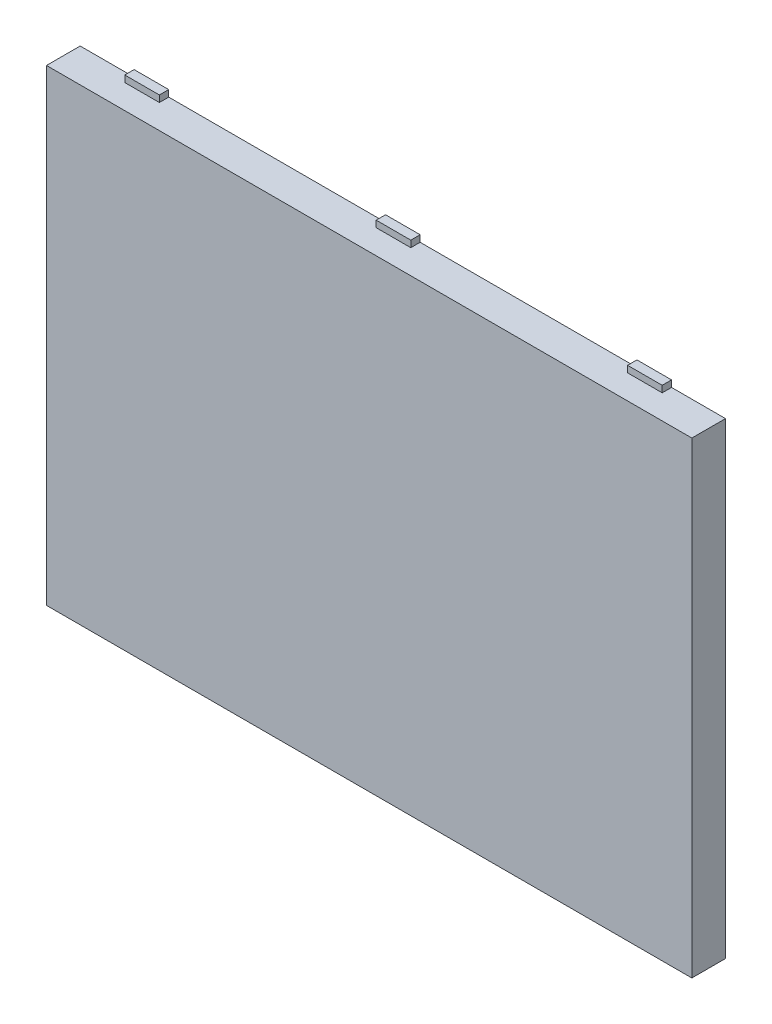
ISO-10303-21;
HEADER;
FILE_DESCRIPTION(('STEP AP214'),'2;1');
FILE_NAME('part.step','',(''),(''),'','','');
FILE_SCHEMA(('AUTOMOTIVE_DESIGN { 1 0 10303 214 1 1 1 1 }'));
ENDSEC;
DATA;
#1=APPLICATION_CONTEXT('core data for automotive mechanical design processes');
#2=APPLICATION_PROTOCOL_DEFINITION('international standard','automotive_design',2000,#1);
#3=PRODUCT_CONTEXT('',#1,'mechanical');
#4=PRODUCT('Part','Part','',(#3));
#5=PRODUCT_RELATED_PRODUCT_CATEGORY('part','',(#4));
#6=PRODUCT_DEFINITION_FORMATION('','',#4);
#7=PRODUCT_DEFINITION_CONTEXT('part definition',#1,'design');
#8=PRODUCT_DEFINITION('design','',#6,#7);
#9=PRODUCT_DEFINITION_SHAPE('','',#8);
#10=(LENGTH_UNIT() NAMED_UNIT(*) SI_UNIT(.MILLI.,.METRE.));
#11=(NAMED_UNIT(*) PLANE_ANGLE_UNIT() SI_UNIT($,.RADIAN.));
#12=(NAMED_UNIT(*) SI_UNIT($,.STERADIAN.) SOLID_ANGLE_UNIT());
#13=UNCERTAINTY_MEASURE_WITH_UNIT(LENGTH_MEASURE(1.E-05),#10,'distance_accuracy_value','');
#14=(GEOMETRIC_REPRESENTATION_CONTEXT(3) GLOBAL_UNCERTAINTY_ASSIGNED_CONTEXT((#13)) GLOBAL_UNIT_ASSIGNED_CONTEXT((#10,
#11,#12)) REPRESENTATION_CONTEXT('',''));
#15=CARTESIAN_POINT('',(0.,0.,0.));
#16=DIRECTION('',(0.,0.,1.));
#17=DIRECTION('',(1.,0.,0.));
#18=AXIS2_PLACEMENT_3D('',#15,#16,#17);
#19=CARTESIAN_POINT('',(0.,0.,3.6));
#20=DIRECTION('',(0.,0.,1.));
#21=DIRECTION('',(1.,0.,0.));
#22=AXIS2_PLACEMENT_3D('',#19,#20,#21);
#23=PLANE('',#22);
#24=DIRECTION('',(-1.,0.,0.));
#25=VECTOR('',#24,1.);
#26=CARTESIAN_POINT('',(73.977502485758,-2.387499067475,3.6));
#27=LINE('',#26,#25);
#28=CARTESIAN_POINT('',(73.977502485758,-2.387499067475,3.6));
#29=VERTEX_POINT('',#28);
#30=CARTESIAN_POINT('',(4.977502485758,-2.387499067475,3.6));
#31=VERTEX_POINT('',#30);
#32=EDGE_CURVE('E430',#29,#31,#27,.T.);
#33=ORIENTED_EDGE('',*,*,#32,.T.);
#34=DIRECTION('',(0.,-1.,0.));
#35=VECTOR('',#34,1.);
#36=CARTESIAN_POINT('',(4.977502485758,-2.387499067475,3.6));
#37=LINE('',#36,#35);
#38=CARTESIAN_POINT('',(4.977502485758,-52.38749906747,3.6));
#39=VERTEX_POINT('',#38);
#40=EDGE_CURVE('E10',#31,#39,#37,.T.);
#41=ORIENTED_EDGE('',*,*,#40,.T.);
#42=DIRECTION('',(1.,0.,0.));
#43=VECTOR('',#42,1.);
#44=CARTESIAN_POINT('',(4.977502485758,-52.38749906747,3.6));
#45=LINE('',#44,#43);
#46=CARTESIAN_POINT('',(73.977502485758,-52.38749906747,3.6));
#47=VERTEX_POINT('',#46);
#48=EDGE_CURVE('E273',#39,#47,#45,.T.);
#49=ORIENTED_EDGE('',*,*,#48,.T.);
#50=DIRECTION('',(0.,1.,0.));
#51=VECTOR('',#50,1.);
#52=CARTESIAN_POINT('',(73.977502485758,-52.38749906747,3.6));
#53=LINE('',#52,#51);
#54=EDGE_CURVE('E25',#47,#29,#53,.T.);
#55=ORIENTED_EDGE('',*,*,#54,.T.);
#56=EDGE_LOOP('',(#33,#41,#49,#55));
#57=FACE_BOUND('',#56,.T.);
#58=ADVANCED_FACE('F16',(#57),#23,.T.);
#59=CARTESIAN_POINT('',(64.509220466931,-1.687499067475,1.));
#60=DIRECTION('',(0.,1.,0.));
#61=DIRECTION('',(1.,0.,0.));
#62=AXIS2_PLACEMENT_3D('',#59,#60,#61);
#63=PLANE('',#62);
#64=DIRECTION('',(1.,0.,0.));
#65=VECTOR('',#64,1.);
#66=CARTESIAN_POINT('',(64.509220466931,-1.687499067475,1.));
#67=LINE('',#66,#65);
#68=CARTESIAN_POINT('',(64.509220466931,-1.687499067475,1.));
#69=VERTEX_POINT('',#68);
#70=CARTESIAN_POINT('',(68.209220466931,-1.687499067475,1.));
#71=VERTEX_POINT('',#70);
#72=EDGE_CURVE('E449',#69,#71,#67,.T.);
#73=ORIENTED_EDGE('',*,*,#72,.T.);
#74=DIRECTION('',(0.,0.,-1.));
#75=VECTOR('',#74,1.);
#76=CARTESIAN_POINT('',(68.209220466931,-1.687499067475,1.));
#77=LINE('',#76,#75);
#78=CARTESIAN_POINT('',(68.209220466931,-1.687499067475,0.));
#79=VERTEX_POINT('',#78);
#80=EDGE_CURVE('E378',#71,#79,#77,.T.);
#81=ORIENTED_EDGE('',*,*,#80,.T.);
#82=DIRECTION('',(1.,0.,0.));
#83=VECTOR('',#82,1.);
#84=CARTESIAN_POINT('',(64.509220466931,-1.687499067475,0.));
#85=LINE('',#84,#83);
#86=CARTESIAN_POINT('',(64.509220466931,-1.687499067475,0.));
#87=VERTEX_POINT('',#86);
#88=EDGE_CURVE('E448',#87,#79,#85,.T.);
#89=ORIENTED_EDGE('',*,*,#88,.F.);
#90=DIRECTION('',(0.,0.,-1.));
#91=VECTOR('',#90,1.);
#92=CARTESIAN_POINT('',(64.509220466931,-1.687499067475,1.));
#93=LINE('',#92,#91);
#94=EDGE_CURVE('E374',#69,#87,#93,.T.);
#95=ORIENTED_EDGE('',*,*,#94,.F.);
#96=EDGE_LOOP('',(#73,#81,#89,#95));
#97=FACE_BOUND('',#96,.T.);
#98=ADVANCED_FACE('F637',(#97),#63,.T.);
#99=CARTESIAN_POINT('',(37.627502485758,-1.687499067475,1.));
#100=DIRECTION('',(0.,1.,0.));
#101=DIRECTION('',(1.,0.,0.));
#102=AXIS2_PLACEMENT_3D('',#99,#100,#101);
#103=PLANE('',#102);
#104=DIRECTION('',(1.,0.,0.));
#105=VECTOR('',#104,1.);
#106=CARTESIAN_POINT('',(37.627502485758,-1.687499067475,1.));
#107=LINE('',#106,#105);
#108=CARTESIAN_POINT('',(37.627502485758,-1.687499067475,1.));
#109=VERTEX_POINT('',#108);
#110=CARTESIAN_POINT('',(41.327502485758,-1.687499067475,1.));
#111=VERTEX_POINT('',#110);
#112=EDGE_CURVE('E338',#109,#111,#107,.T.);
#113=ORIENTED_EDGE('',*,*,#112,.T.);
#114=DIRECTION('',(0.,0.,-1.));
#115=VECTOR('',#114,1.);
#116=CARTESIAN_POINT('',(41.327502485758,-1.687499067475,1.));
#117=LINE('',#116,#115);
#118=CARTESIAN_POINT('',(41.327502485758,-1.687499067475,0.));
#119=VERTEX_POINT('',#118);
#120=EDGE_CURVE('E388',#111,#119,#117,.T.);
#121=ORIENTED_EDGE('',*,*,#120,.T.);
#122=DIRECTION('',(1.,0.,0.));
#123=VECTOR('',#122,1.);
#124=CARTESIAN_POINT('',(37.627502485758,-1.687499067475,0.));
#125=LINE('',#124,#123);
#126=CARTESIAN_POINT('',(37.627502485758,-1.687499067475,0.));
#127=VERTEX_POINT('',#126);
#128=EDGE_CURVE('E421',#127,#119,#125,.T.);
#129=ORIENTED_EDGE('',*,*,#128,.F.);
#130=DIRECTION('',(0.,0.,-1.));
#131=VECTOR('',#130,1.);
#132=CARTESIAN_POINT('',(37.627502485758,-1.687499067475,1.));
#133=LINE('',#132,#131);
#134=EDGE_CURVE('E384',#109,#127,#133,.T.);
#135=ORIENTED_EDGE('',*,*,#134,.F.);
#136=EDGE_LOOP('',(#113,#121,#129,#135));
#137=FACE_BOUND('',#136,.T.);
#138=ADVANCED_FACE('F18',(#137),#103,.T.);
#139=CARTESIAN_POINT('',(10.745784504586,-1.687499067475,1.));
#140=DIRECTION('',(0.,1.,0.));
#141=DIRECTION('',(1.,0.,0.));
#142=AXIS2_PLACEMENT_3D('',#139,#140,#141);
#143=PLANE('',#142);
#144=DIRECTION('',(1.,0.,0.));
#145=VECTOR('',#144,1.);
#146=CARTESIAN_POINT('',(10.745784504586,-1.687499067475,1.));
#147=LINE('',#146,#145);
#148=CARTESIAN_POINT('',(10.745784504586,-1.687499067475,1.));
#149=VERTEX_POINT('',#148);
#150=CARTESIAN_POINT('',(14.445784504586,-1.687499067475,1.));
#151=VERTEX_POINT('',#150);
#152=EDGE_CURVE('E535',#149,#151,#147,.T.);
#153=ORIENTED_EDGE('',*,*,#152,.T.);
#154=DIRECTION('',(0.,0.,-1.));
#155=VECTOR('',#154,1.);
#156=CARTESIAN_POINT('',(14.445784504586,-1.687499067475,1.));
#157=LINE('',#156,#155);
#158=CARTESIAN_POINT('',(14.445784504586,-1.687499067475,0.));
#159=VERTEX_POINT('',#158);
#160=EDGE_CURVE('E547',#151,#159,#157,.T.);
#161=ORIENTED_EDGE('',*,*,#160,.T.);
#162=DIRECTION('',(1.,0.,0.));
#163=VECTOR('',#162,1.);
#164=CARTESIAN_POINT('',(10.745784504586,-1.687499067475,0.));
#165=LINE('',#164,#163);
#166=CARTESIAN_POINT('',(10.745784504586,-1.687499067475,0.));
#167=VERTEX_POINT('',#166);
#168=EDGE_CURVE('E401',#167,#159,#165,.T.);
#169=ORIENTED_EDGE('',*,*,#168,.F.);
#170=DIRECTION('',(0.,0.,-1.));
#171=VECTOR('',#170,1.);
#172=CARTESIAN_POINT('',(10.745784504586,-1.687499067475,1.));
#173=LINE('',#172,#171);
#174=EDGE_CURVE('E550',#149,#167,#173,.T.);
#175=ORIENTED_EDGE('',*,*,#174,.F.);
#176=EDGE_LOOP('',(#153,#161,#169,#175));
#177=FACE_BOUND('',#176,.T.);
#178=ADVANCED_FACE('F706',(#177),#143,.T.);
#179=CARTESIAN_POINT('',(4.977502485758,-2.387499067475,0.));
#180=DIRECTION('',(-1.,0.,0.));
#181=DIRECTION('',(0.,0.,1.));
#182=AXIS2_PLACEMENT_3D('',#179,#180,#181);
#183=PLANE('',#182);
#184=DIRECTION('',(0.,-1.,0.));
#185=VECTOR('',#184,1.);
#186=CARTESIAN_POINT('',(4.977502485758,-2.387499067475,0.));
#187=LINE('',#186,#185);
#188=CARTESIAN_POINT('',(4.977502485758,-2.387499067475,0.));
#189=VERTEX_POINT('',#188);
#190=CARTESIAN_POINT('',(4.977502485758,-52.38749906747,0.));
#191=VERTEX_POINT('',#190);
#192=EDGE_CURVE('E359',#189,#191,#187,.T.);
#193=ORIENTED_EDGE('',*,*,#192,.T.);
#194=DIRECTION('',(0.,0.,1.));
#195=VECTOR('',#194,1.);
#196=CARTESIAN_POINT('',(4.977502485758,-52.38749906747,0.));
#197=LINE('',#196,#195);
#198=EDGE_CURVE('E303',#191,#39,#197,.T.);
#199=ORIENTED_EDGE('',*,*,#198,.T.);
#200=ORIENTED_EDGE('',*,*,#40,.F.);
#201=DIRECTION('',(0.,0.,1.));
#202=VECTOR('',#201,1.);
#203=CARTESIAN_POINT('',(4.977502485758,-2.387499067475,0.));
#204=LINE('',#203,#202);
#205=EDGE_CURVE('E323',#189,#31,#204,.T.);
#206=ORIENTED_EDGE('',*,*,#205,.F.);
#207=EDGE_LOOP('',(#193,#199,#200,#206));
#208=FACE_BOUND('',#207,.T.);
#209=ADVANCED_FACE('F582',(#208),#183,.T.);
#210=CARTESIAN_POINT('',(14.445784504586,-53.08749906747,1.));
#211=DIRECTION('',(0.,-1.,0.));
#212=DIRECTION('',(0.,0.,-1.));
#213=AXIS2_PLACEMENT_3D('',#210,#211,#212);
#214=PLANE('',#213);
#215=DIRECTION('',(-1.,0.,0.));
#216=VECTOR('',#215,1.);
#217=CARTESIAN_POINT('',(14.445784504586,-53.08749906747,1.));
#218=LINE('',#217,#216);
#219=CARTESIAN_POINT('',(14.445784504586,-53.08749906747,1.));
#220=VERTEX_POINT('',#219);
#221=CARTESIAN_POINT('',(10.745784504586,-53.08749906747,1.));
#222=VERTEX_POINT('',#221);
#223=EDGE_CURVE('E509',#220,#222,#218,.T.);
#224=ORIENTED_EDGE('',*,*,#223,.T.);
#225=DIRECTION('',(0.,0.,-1.));
#226=VECTOR('',#225,1.);
#227=CARTESIAN_POINT('',(10.745784504586,-53.08749906747,1.));
#228=LINE('',#227,#226);
#229=CARTESIAN_POINT('',(10.745784504586,-53.08749906747,0.));
#230=VERTEX_POINT('',#229);
#231=EDGE_CURVE('E523',#222,#230,#228,.T.);
#232=ORIENTED_EDGE('',*,*,#231,.T.);
#233=DIRECTION('',(-1.,0.,0.));
#234=VECTOR('',#233,1.);
#235=CARTESIAN_POINT('',(14.445784504586,-53.08749906747,0.));
#236=LINE('',#235,#234);
#237=CARTESIAN_POINT('',(14.445784504586,-53.08749906747,0.));
#238=VERTEX_POINT('',#237);
#239=EDGE_CURVE('E379',#238,#230,#236,.T.);
#240=ORIENTED_EDGE('',*,*,#239,.F.);
#241=DIRECTION('',(0.,0.,-1.));
#242=VECTOR('',#241,1.);
#243=CARTESIAN_POINT('',(14.445784504586,-53.08749906747,1.));
#244=LINE('',#243,#242);
#245=EDGE_CURVE('E526',#220,#238,#244,.T.);
#246=ORIENTED_EDGE('',*,*,#245,.F.);
#247=EDGE_LOOP('',(#224,#232,#240,#246));
#248=FACE_BOUND('',#247,.T.);
#249=ADVANCED_FACE('F633',(#248),#214,.T.);
#250=CARTESIAN_POINT('',(41.327502485758,-53.08749906747,1.));
#251=DIRECTION('',(0.,-1.,0.));
#252=DIRECTION('',(0.,0.,-1.));
#253=AXIS2_PLACEMENT_3D('',#250,#251,#252);
#254=PLANE('',#253);
#255=DIRECTION('',(-1.,0.,0.));
#256=VECTOR('',#255,1.);
#257=CARTESIAN_POINT('',(41.327502485758,-53.08749906747,1.));
#258=LINE('',#257,#256);
#259=CARTESIAN_POINT('',(41.327502485758,-53.08749906747,1.));
#260=VERTEX_POINT('',#259);
#261=CARTESIAN_POINT('',(37.627502485758,-53.08749906747,1.));
#262=VERTEX_POINT('',#261);
#263=EDGE_CURVE('E363',#260,#262,#258,.T.);
#264=ORIENTED_EDGE('',*,*,#263,.T.);
#265=DIRECTION('',(0.,0.,-1.));
#266=VECTOR('',#265,1.);
#267=CARTESIAN_POINT('',(37.627502485758,-53.08749906747,1.));
#268=LINE('',#267,#266);
#269=CARTESIAN_POINT('',(37.627502485758,-53.08749906747,0.));
#270=VERTEX_POINT('',#269);
#271=EDGE_CURVE('E47',#262,#270,#268,.T.);
#272=ORIENTED_EDGE('',*,*,#271,.T.);
#273=DIRECTION('',(-1.,0.,0.));
#274=VECTOR('',#273,1.);
#275=CARTESIAN_POINT('',(41.327502485758,-53.08749906747,0.));
#276=LINE('',#275,#274);
#277=CARTESIAN_POINT('',(41.327502485758,-53.08749906747,0.));
#278=VERTEX_POINT('',#277);
#279=EDGE_CURVE('E353',#278,#270,#276,.T.);
#280=ORIENTED_EDGE('',*,*,#279,.F.);
#281=DIRECTION('',(0.,0.,-1.));
#282=VECTOR('',#281,1.);
#283=CARTESIAN_POINT('',(41.327502485758,-53.08749906747,1.));
#284=LINE('',#283,#282);
#285=EDGE_CURVE('E37',#260,#278,#284,.T.);
#286=ORIENTED_EDGE('',*,*,#285,.F.);
#287=EDGE_LOOP('',(#264,#272,#280,#286));
#288=FACE_BOUND('',#287,.T.);
#289=ADVANCED_FACE('F625',(#288),#254,.T.);
#290=CARTESIAN_POINT('',(68.209220466931,-53.08749906747,1.));
#291=DIRECTION('',(0.,-1.,0.));
#292=DIRECTION('',(0.,0.,-1.));
#293=AXIS2_PLACEMENT_3D('',#290,#291,#292);
#294=PLANE('',#293);
#295=DIRECTION('',(-1.,0.,0.));
#296=VECTOR('',#295,1.);
#297=CARTESIAN_POINT('',(68.209220466931,-53.08749906747,1.));
#298=LINE('',#297,#296);
#299=CARTESIAN_POINT('',(68.209220466931,-53.08749906747,1.));
#300=VERTEX_POINT('',#299);
#301=CARTESIAN_POINT('',(64.509220466931,-53.08749906747,1.));
#302=VERTEX_POINT('',#301);
#303=EDGE_CURVE('E486',#300,#302,#298,.T.);
#304=ORIENTED_EDGE('',*,*,#303,.T.);
#305=DIRECTION('',(0.,0.,-1.));
#306=VECTOR('',#305,1.);
#307=CARTESIAN_POINT('',(64.509220466931,-53.08749906747,1.));
#308=LINE('',#307,#306);
#309=CARTESIAN_POINT('',(64.509220466931,-53.08749906747,0.));
#310=VERTEX_POINT('',#309);
#311=EDGE_CURVE('E309',#302,#310,#308,.T.);
#312=ORIENTED_EDGE('',*,*,#311,.T.);
#313=DIRECTION('',(-1.,0.,0.));
#314=VECTOR('',#313,1.);
#315=CARTESIAN_POINT('',(68.209220466931,-53.08749906747,0.));
#316=LINE('',#315,#314);
#317=CARTESIAN_POINT('',(68.209220466931,-53.08749906747,0.));
#318=VERTEX_POINT('',#317);
#319=EDGE_CURVE('E318',#318,#310,#316,.T.);
#320=ORIENTED_EDGE('',*,*,#319,.F.);
#321=DIRECTION('',(0.,0.,-1.));
#322=VECTOR('',#321,1.);
#323=CARTESIAN_POINT('',(68.209220466931,-53.08749906747,1.));
#324=LINE('',#323,#322);
#325=EDGE_CURVE('E305',#300,#318,#324,.T.);
#326=ORIENTED_EDGE('',*,*,#325,.F.);
#327=EDGE_LOOP('',(#304,#312,#320,#326));
#328=FACE_BOUND('',#327,.T.);
#329=ADVANCED_FACE('F623',(#328),#294,.T.);
#330=CARTESIAN_POINT('',(73.977502485758,-52.38749906747,0.));
#331=DIRECTION('',(1.,0.,0.));
#332=DIRECTION('',(0.,-1.,0.));
#333=AXIS2_PLACEMENT_3D('',#330,#331,#332);
#334=PLANE('',#333);
#335=DIRECTION('',(0.,1.,0.));
#336=VECTOR('',#335,1.);
#337=CARTESIAN_POINT('',(73.977502485758,-52.38749906747,0.));
#338=LINE('',#337,#336);
#339=CARTESIAN_POINT('',(73.977502485758,-52.38749906747,0.));
#340=VERTEX_POINT('',#339);
#341=CARTESIAN_POINT('',(73.977502485758,-2.387499067475,0.));
#342=VERTEX_POINT('',#341);
#343=EDGE_CURVE('E268',#340,#342,#338,.T.);
#344=ORIENTED_EDGE('',*,*,#343,.T.);
#345=DIRECTION('',(0.,0.,1.));
#346=VECTOR('',#345,1.);
#347=CARTESIAN_POINT('',(73.977502485758,-2.387499067475,0.));
#348=LINE('',#347,#346);
#349=EDGE_CURVE('E434',#342,#29,#348,.T.);
#350=ORIENTED_EDGE('',*,*,#349,.T.);
#351=ORIENTED_EDGE('',*,*,#54,.F.);
#352=DIRECTION('',(0.,0.,1.));
#353=VECTOR('',#352,1.);
#354=CARTESIAN_POINT('',(73.977502485758,-52.38749906747,0.));
#355=LINE('',#354,#353);
#356=EDGE_CURVE('E263',#340,#47,#355,.T.);
#357=ORIENTED_EDGE('',*,*,#356,.F.);
#358=EDGE_LOOP('',(#344,#350,#351,#357));
#359=FACE_BOUND('',#358,.T.);
#360=ADVANCED_FACE('F265',(#359),#334,.T.);
#361=CARTESIAN_POINT('',(41.327502485758,-52.38749906747,1.));
#362=DIRECTION('',(1.,0.,0.));
#363=DIRECTION('',(0.,1.,0.));
#364=AXIS2_PLACEMENT_3D('',#361,#362,#363);
#365=PLANE('',#364);
#366=DIRECTION('',(0.,0.,1.));
#367=VECTOR('',#366,1.);
#368=CARTESIAN_POINT('',(41.327502485758,-52.38749906747,0.));
#369=LINE('',#368,#367);
#370=CARTESIAN_POINT('',(41.327502485758,-52.38749906747,0.));
#371=VERTEX_POINT('',#370);
#372=CARTESIAN_POINT('',(41.327502485758,-52.38749906747,1.));
#373=VERTEX_POINT('',#372);
#374=EDGE_CURVE('E416',#371,#373,#369,.T.);
#375=ORIENTED_EDGE('',*,*,#374,.T.);
#376=DIRECTION('',(0.,-1.,0.));
#377=VECTOR('',#376,1.);
#378=CARTESIAN_POINT('',(41.327502485758,-52.38749906747,1.));
#379=LINE('',#378,#377);
#380=EDGE_CURVE('E360',#373,#260,#379,.T.);
#381=ORIENTED_EDGE('',*,*,#380,.T.);
#382=ORIENTED_EDGE('',*,*,#285,.T.);
#383=DIRECTION('',(0.,-1.,0.));
#384=VECTOR('',#383,1.);
#385=CARTESIAN_POINT('',(41.327502485758,-52.38749906747,0.));
#386=LINE('',#385,#384);
#387=EDGE_CURVE('E347',#371,#278,#386,.T.);
#388=ORIENTED_EDGE('',*,*,#387,.F.);
#389=EDGE_LOOP('',(#375,#381,#382,#388));
#390=FACE_BOUND('',#389,.T.);
#391=ADVANCED_FACE('F607',(#390),#365,.T.);
#392=CARTESIAN_POINT('',(37.627502485758,-53.08749906747,1.));
#393=DIRECTION('',(-1.,0.,0.));
#394=DIRECTION('',(0.,0.,1.));
#395=AXIS2_PLACEMENT_3D('',#392,#393,#394);
#396=PLANE('',#395);
#397=DIRECTION('',(0.,0.,-1.));
#398=VECTOR('',#397,1.);
#399=CARTESIAN_POINT('',(37.627502485758,-52.38749906747,1.));
#400=LINE('',#399,#398);
#401=CARTESIAN_POINT('',(37.627502485758,-52.38749906747,1.));
#402=VERTEX_POINT('',#401);
#403=CARTESIAN_POINT('',(37.627502485758,-52.38749906747,0.));
#404=VERTEX_POINT('',#403);
#405=EDGE_CURVE('E461',#402,#404,#400,.T.);
#406=ORIENTED_EDGE('',*,*,#405,.T.);
#407=DIRECTION('',(0.,1.,0.));
#408=VECTOR('',#407,1.);
#409=CARTESIAN_POINT('',(37.627502485758,-53.08749906747,0.));
#410=LINE('',#409,#408);
#411=EDGE_CURVE('E337',#270,#404,#410,.T.);
#412=ORIENTED_EDGE('',*,*,#411,.F.);
#413=ORIENTED_EDGE('',*,*,#271,.F.);
#414=DIRECTION('',(0.,1.,0.));
#415=VECTOR('',#414,1.);
#416=CARTESIAN_POINT('',(37.627502485758,-53.08749906747,1.));
#417=LINE('',#416,#415);
#418=EDGE_CURVE('E377',#262,#402,#417,.T.);
#419=ORIENTED_EDGE('',*,*,#418,.T.);
#420=EDGE_LOOP('',(#406,#412,#413,#419));
#421=FACE_BOUND('',#420,.T.);
#422=ADVANCED_FACE('F601',(#421),#396,.T.);
#423=CARTESIAN_POINT('',(0.,0.,1.));
#424=DIRECTION('',(0.,0.,-1.));
#425=DIRECTION('',(0.,-1.,0.));
#426=AXIS2_PLACEMENT_3D('',#423,#424,#425);
#427=PLANE('',#426);
#428=DIRECTION('',(1.,0.,0.));
#429=VECTOR('',#428,1.);
#430=CARTESIAN_POINT('',(37.627502485758,-52.38749906747,1.));
#431=LINE('',#430,#429);
#432=EDGE_CURVE('E464',#402,#373,#431,.T.);
#433=ORIENTED_EDGE('',*,*,#432,.F.);
#434=ORIENTED_EDGE('',*,*,#418,.F.);
#435=ORIENTED_EDGE('',*,*,#263,.F.);
#436=ORIENTED_EDGE('',*,*,#380,.F.);
#437=EDGE_LOOP('',(#433,#434,#435,#436));
#438=FACE_BOUND('',#437,.T.);
#439=ADVANCED_FACE('F647',(#438),#427,.F.);
#440=CARTESIAN_POINT('',(64.509220466931,-2.387499067475,1.));
#441=DIRECTION('',(-1.,0.,0.));
#442=DIRECTION('',(0.,0.,1.));
#443=AXIS2_PLACEMENT_3D('',#440,#441,#442);
#444=PLANE('',#443);
#445=DIRECTION('',(0.,0.,1.));
#446=VECTOR('',#445,1.);
#447=CARTESIAN_POINT('',(64.509220466931,-2.387499067475,0.));
#448=LINE('',#447,#446);
#449=CARTESIAN_POINT('',(64.509220466931,-2.387499067475,0.));
#450=VERTEX_POINT('',#449);
#451=CARTESIAN_POINT('',(64.509220466931,-2.387499067475,1.));
#452=VERTEX_POINT('',#451);
#453=EDGE_CURVE('E493',#450,#452,#448,.T.);
#454=ORIENTED_EDGE('',*,*,#453,.T.);
#455=DIRECTION('',(0.,1.,0.));
#456=VECTOR('',#455,1.);
#457=CARTESIAN_POINT('',(64.509220466931,-2.387499067475,1.));
#458=LINE('',#457,#456);
#459=EDGE_CURVE('E453',#452,#69,#458,.T.);
#460=ORIENTED_EDGE('',*,*,#459,.T.);
#461=ORIENTED_EDGE('',*,*,#94,.T.);
#462=DIRECTION('',(0.,1.,0.));
#463=VECTOR('',#462,1.);
#464=CARTESIAN_POINT('',(64.509220466931,-2.387499067475,0.));
#465=LINE('',#464,#463);
#466=EDGE_CURVE('E438',#450,#87,#465,.T.);
#467=ORIENTED_EDGE('',*,*,#466,.F.);
#468=EDGE_LOOP('',(#454,#460,#461,#467));
#469=FACE_BOUND('',#468,.T.);
#470=ADVANCED_FACE('F697',(#469),#444,.T.);
#471=CARTESIAN_POINT('',(68.209220466931,-1.687499067475,1.));
#472=DIRECTION('',(1.,0.,0.));
#473=DIRECTION('',(0.,1.,0.));
#474=AXIS2_PLACEMENT_3D('',#471,#472,#473);
#475=PLANE('',#474);
#476=DIRECTION('',(0.,0.,-1.));
#477=VECTOR('',#476,1.);
#478=CARTESIAN_POINT('',(68.209220466931,-2.387499067475,1.));
#479=LINE('',#478,#477);
#480=CARTESIAN_POINT('',(68.209220466931,-2.387499067475,1.));
#481=VERTEX_POINT('',#480);
#482=CARTESIAN_POINT('',(68.209220466931,-2.387499067475,0.));
#483=VERTEX_POINT('',#482);
#484=EDGE_CURVE('E444',#481,#483,#479,.T.);
#485=ORIENTED_EDGE('',*,*,#484,.T.);
#486=DIRECTION('',(0.,-1.,0.));
#487=VECTOR('',#486,1.);
#488=CARTESIAN_POINT('',(68.209220466931,-1.687499067475,0.));
#489=LINE('',#488,#487);
#490=EDGE_CURVE('E417',#79,#483,#489,.T.);
#491=ORIENTED_EDGE('',*,*,#490,.F.);
#492=ORIENTED_EDGE('',*,*,#80,.F.);
#493=DIRECTION('',(0.,-1.,0.));
#494=VECTOR('',#493,1.);
#495=CARTESIAN_POINT('',(68.209220466931,-1.687499067475,1.));
#496=LINE('',#495,#494);
#497=EDGE_CURVE('E387',#71,#481,#496,.T.);
#498=ORIENTED_EDGE('',*,*,#497,.T.);
#499=EDGE_LOOP('',(#485,#491,#492,#498));
#500=FACE_BOUND('',#499,.T.);
#501=ADVANCED_FACE('F692',(#500),#475,.T.);
#502=CARTESIAN_POINT('',(0.,0.,1.));
#503=DIRECTION('',(0.,0.,-1.));
#504=DIRECTION('',(0.,-1.,0.));
#505=AXIS2_PLACEMENT_3D('',#502,#503,#504);
#506=PLANE('',#505);
#507=DIRECTION('',(-1.,0.,0.));
#508=VECTOR('',#507,1.);
#509=CARTESIAN_POINT('',(68.209220466931,-2.387499067475,1.));
#510=LINE('',#509,#508);
#511=EDGE_CURVE('E439',#481,#452,#510,.T.);
#512=ORIENTED_EDGE('',*,*,#511,.F.);
#513=ORIENTED_EDGE('',*,*,#497,.F.);
#514=ORIENTED_EDGE('',*,*,#72,.F.);
#515=ORIENTED_EDGE('',*,*,#459,.F.);
#516=EDGE_LOOP('',(#512,#513,#514,#515));
#517=FACE_BOUND('',#516,.T.);
#518=ADVANCED_FACE('F656',(#517),#506,.F.);
#519=CARTESIAN_POINT('',(37.627502485758,-2.387499067475,1.));
#520=DIRECTION('',(-1.,0.,0.));
#521=DIRECTION('',(0.,0.,1.));
#522=AXIS2_PLACEMENT_3D('',#519,#520,#521);
#523=PLANE('',#522);
#524=DIRECTION('',(0.,0.,1.));
#525=VECTOR('',#524,1.);
#526=CARTESIAN_POINT('',(37.627502485758,-2.387499067475,0.));
#527=LINE('',#526,#525);
#528=CARTESIAN_POINT('',(37.627502485758,-2.387499067475,0.));
#529=VERTEX_POINT('',#528);
#530=CARTESIAN_POINT('',(37.627502485758,-2.387499067475,1.));
#531=VERTEX_POINT('',#530);
#532=EDGE_CURVE('E314',#529,#531,#527,.T.);
#533=ORIENTED_EDGE('',*,*,#532,.T.);
#534=DIRECTION('',(0.,1.,0.));
#535=VECTOR('',#534,1.);
#536=CARTESIAN_POINT('',(37.627502485758,-2.387499067475,1.));
#537=LINE('',#536,#535);
#538=EDGE_CURVE('E342',#531,#109,#537,.T.);
#539=ORIENTED_EDGE('',*,*,#538,.T.);
#540=ORIENTED_EDGE('',*,*,#134,.T.);
#541=DIRECTION('',(0.,1.,0.));
#542=VECTOR('',#541,1.);
#543=CARTESIAN_POINT('',(37.627502485758,-2.387499067475,0.));
#544=LINE('',#543,#542);
#545=EDGE_CURVE('E413',#529,#127,#544,.T.);
#546=ORIENTED_EDGE('',*,*,#545,.F.);
#547=EDGE_LOOP('',(#533,#539,#540,#546));
#548=FACE_BOUND('',#547,.T.);
#549=ADVANCED_FACE('F652',(#548),#523,.T.);
#550=CARTESIAN_POINT('',(41.327502485758,-1.687499067475,1.));
#551=DIRECTION('',(1.,0.,0.));
#552=DIRECTION('',(0.,1.,0.));
#553=AXIS2_PLACEMENT_3D('',#550,#551,#552);
#554=PLANE('',#553);
#555=DIRECTION('',(0.,0.,-1.));
#556=VECTOR('',#555,1.);
#557=CARTESIAN_POINT('',(41.327502485758,-2.387499067475,1.));
#558=LINE('',#557,#556);
#559=CARTESIAN_POINT('',(41.327502485758,-2.387499067475,1.));
#560=VERTEX_POINT('',#559);
#561=CARTESIAN_POINT('',(41.327502485758,-2.387499067475,0.));
#562=VERTEX_POINT('',#561);
#563=EDGE_CURVE('E315',#560,#562,#558,.T.);
#564=ORIENTED_EDGE('',*,*,#563,.T.);
#565=DIRECTION('',(0.,-1.,0.));
#566=VECTOR('',#565,1.);
#567=CARTESIAN_POINT('',(41.327502485758,-1.687499067475,0.));
#568=LINE('',#567,#566);
#569=EDGE_CURVE('E425',#119,#562,#568,.T.);
#570=ORIENTED_EDGE('',*,*,#569,.F.);
#571=ORIENTED_EDGE('',*,*,#120,.F.);
#572=DIRECTION('',(0.,-1.,0.));
#573=VECTOR('',#572,1.);
#574=CARTESIAN_POINT('',(41.327502485758,-1.687499067475,1.));
#575=LINE('',#574,#573);
#576=EDGE_CURVE('E343',#111,#560,#575,.T.);
#577=ORIENTED_EDGE('',*,*,#576,.T.);
#578=EDGE_LOOP('',(#564,#570,#571,#577));
#579=FACE_BOUND('',#578,.T.);
#580=ADVANCED_FACE('F655',(#579),#554,.T.);
#581=CARTESIAN_POINT('',(0.,0.,1.));
#582=DIRECTION('',(0.,0.,-1.));
#583=DIRECTION('',(0.,-1.,0.));
#584=AXIS2_PLACEMENT_3D('',#581,#582,#583);
#585=PLANE('',#584);
#586=DIRECTION('',(-1.,0.,0.));
#587=VECTOR('',#586,1.);
#588=CARTESIAN_POINT('',(41.327502485758,-2.387499067475,1.));
#589=LINE('',#588,#587);
#590=EDGE_CURVE('E310',#560,#531,#589,.T.);
#591=ORIENTED_EDGE('',*,*,#590,.F.);
#592=ORIENTED_EDGE('',*,*,#576,.F.);
#593=ORIENTED_EDGE('',*,*,#112,.F.);
#594=ORIENTED_EDGE('',*,*,#538,.F.);
#595=EDGE_LOOP('',(#591,#592,#593,#594));
#596=FACE_BOUND('',#595,.T.);
#597=ADVANCED_FACE('F683',(#596),#585,.F.);
#598=CARTESIAN_POINT('',(10.745784504586,-2.387499067475,1.));
#599=DIRECTION('',(-1.,0.,0.));
#600=DIRECTION('',(0.,0.,1.));
#601=AXIS2_PLACEMENT_3D('',#598,#599,#600);
#602=PLANE('',#601);
#603=DIRECTION('',(0.,0.,1.));
#604=VECTOR('',#603,1.);
#605=CARTESIAN_POINT('',(10.745784504586,-2.387499067475,0.));
#606=LINE('',#605,#604);
#607=CARTESIAN_POINT('',(10.745784504586,-2.387499067475,0.));
#608=VERTEX_POINT('',#607);
#609=CARTESIAN_POINT('',(10.745784504586,-2.387499067475,1.));
#610=VERTEX_POINT('',#609);
#611=EDGE_CURVE('E319',#608,#610,#606,.T.);
#612=ORIENTED_EDGE('',*,*,#611,.T.);
#613=DIRECTION('',(0.,1.,0.));
#614=VECTOR('',#613,1.);
#615=CARTESIAN_POINT('',(10.745784504586,-2.387499067475,1.));
#616=LINE('',#615,#614);
#617=EDGE_CURVE('E539',#610,#149,#616,.T.);
#618=ORIENTED_EDGE('',*,*,#617,.T.);
#619=ORIENTED_EDGE('',*,*,#174,.T.);
#620=DIRECTION('',(0.,1.,0.));
#621=VECTOR('',#620,1.);
#622=CARTESIAN_POINT('',(10.745784504586,-2.387499067475,0.));
#623=LINE('',#622,#621);
#624=EDGE_CURVE('E358',#608,#167,#623,.T.);
#625=ORIENTED_EDGE('',*,*,#624,.F.);
#626=EDGE_LOOP('',(#612,#618,#619,#625));
#627=FACE_BOUND('',#626,.T.);
#628=ADVANCED_FACE('F679',(#627),#602,.T.);
#629=CARTESIAN_POINT('',(14.445784504586,-1.687499067475,1.));
#630=DIRECTION('',(1.,0.,0.));
#631=DIRECTION('',(0.,1.,0.));
#632=AXIS2_PLACEMENT_3D('',#629,#630,#631);
#633=PLANE('',#632);
#634=DIRECTION('',(0.,0.,-1.));
#635=VECTOR('',#634,1.);
#636=CARTESIAN_POINT('',(14.445784504586,-2.387499067475,1.));
#637=LINE('',#636,#635);
#638=CARTESIAN_POINT('',(14.445784504586,-2.387499067475,1.));
#639=VERTEX_POINT('',#638);
#640=CARTESIAN_POINT('',(14.445784504586,-2.387499067475,0.));
#641=VERTEX_POINT('',#640);
#642=EDGE_CURVE('E460',#639,#641,#637,.T.);
#643=ORIENTED_EDGE('',*,*,#642,.T.);
#644=DIRECTION('',(0.,-1.,0.));
#645=VECTOR('',#644,1.);
#646=CARTESIAN_POINT('',(14.445784504586,-1.687499067475,0.));
#647=LINE('',#646,#645);
#648=EDGE_CURVE('E405',#159,#641,#647,.T.);
#649=ORIENTED_EDGE('',*,*,#648,.F.);
#650=ORIENTED_EDGE('',*,*,#160,.F.);
#651=DIRECTION('',(0.,-1.,0.));
#652=VECTOR('',#651,1.);
#653=CARTESIAN_POINT('',(14.445784504586,-1.687499067475,1.));
#654=LINE('',#653,#652);
#655=EDGE_CURVE('E308',#151,#639,#654,.T.);
#656=ORIENTED_EDGE('',*,*,#655,.T.);
#657=EDGE_LOOP('',(#643,#649,#650,#656));
#658=FACE_BOUND('',#657,.T.);
#659=ADVANCED_FACE('F675',(#658),#633,.T.);
#660=CARTESIAN_POINT('',(0.,0.,1.));
#661=DIRECTION('',(0.,0.,-1.));
#662=DIRECTION('',(0.,-1.,0.));
#663=AXIS2_PLACEMENT_3D('',#660,#661,#662);
#664=PLANE('',#663);
#665=DIRECTION('',(-1.,0.,0.));
#666=VECTOR('',#665,1.);
#667=CARTESIAN_POINT('',(14.445784504586,-2.387499067475,1.));
#668=LINE('',#667,#666);
#669=EDGE_CURVE('E324',#639,#610,#668,.T.);
#670=ORIENTED_EDGE('',*,*,#669,.F.);
#671=ORIENTED_EDGE('',*,*,#655,.F.);
#672=ORIENTED_EDGE('',*,*,#152,.F.);
#673=ORIENTED_EDGE('',*,*,#617,.F.);
#674=EDGE_LOOP('',(#670,#671,#672,#673));
#675=FACE_BOUND('',#674,.T.);
#676=ADVANCED_FACE('F660',(#675),#664,.F.);
#677=CARTESIAN_POINT('',(68.209220466931,-52.38749906747,1.));
#678=DIRECTION('',(1.,0.,0.));
#679=DIRECTION('',(0.,1.,0.));
#680=AXIS2_PLACEMENT_3D('',#677,#678,#679);
#681=PLANE('',#680);
#682=DIRECTION('',(0.,0.,1.));
#683=VECTOR('',#682,1.);
#684=CARTESIAN_POINT('',(68.209220466931,-52.38749906747,0.));
#685=LINE('',#684,#683);
#686=CARTESIAN_POINT('',(68.209220466931,-52.38749906747,0.));
#687=VERTEX_POINT('',#686);
#688=CARTESIAN_POINT('',(68.209220466931,-52.38749906747,1.));
#689=VERTEX_POINT('',#688);
#690=EDGE_CURVE('E274',#687,#689,#685,.T.);
#691=ORIENTED_EDGE('',*,*,#690,.T.);
#692=DIRECTION('',(0.,-1.,0.));
#693=VECTOR('',#692,1.);
#694=CARTESIAN_POINT('',(68.209220466931,-52.38749906747,1.));
#695=LINE('',#694,#693);
#696=EDGE_CURVE('E482',#689,#300,#695,.T.);
#697=ORIENTED_EDGE('',*,*,#696,.T.);
#698=ORIENTED_EDGE('',*,*,#325,.T.);
#699=DIRECTION('',(0.,-1.,0.));
#700=VECTOR('',#699,1.);
#701=CARTESIAN_POINT('',(68.209220466931,-52.38749906747,0.));
#702=LINE('',#701,#700);
#703=EDGE_CURVE('E285',#687,#318,#702,.T.);
#704=ORIENTED_EDGE('',*,*,#703,.F.);
#705=EDGE_LOOP('',(#691,#697,#698,#704));
#706=FACE_BOUND('',#705,.T.);
#707=ADVANCED_FACE('F620',(#706),#681,.T.);
#708=CARTESIAN_POINT('',(64.509220466931,-53.08749906747,1.));
#709=DIRECTION('',(-1.,0.,0.));
#710=DIRECTION('',(0.,0.,1.));
#711=AXIS2_PLACEMENT_3D('',#708,#709,#710);
#712=PLANE('',#711);
#713=DIRECTION('',(0.,0.,-1.));
#714=VECTOR('',#713,1.);
#715=CARTESIAN_POINT('',(64.509220466931,-52.38749906747,1.));
#716=LINE('',#715,#714);
#717=CARTESIAN_POINT('',(64.509220466931,-52.38749906747,1.));
#718=VERTEX_POINT('',#717);
#719=CARTESIAN_POINT('',(64.509220466931,-52.38749906747,0.));
#720=VERTEX_POINT('',#719);
#721=EDGE_CURVE('E471',#718,#720,#716,.T.);
#722=ORIENTED_EDGE('',*,*,#721,.T.);
#723=DIRECTION('',(0.,1.,0.));
#724=VECTOR('',#723,1.);
#725=CARTESIAN_POINT('',(64.509220466931,-53.08749906747,0.));
#726=LINE('',#725,#724);
#727=EDGE_CURVE('E328',#310,#720,#726,.T.);
#728=ORIENTED_EDGE('',*,*,#727,.F.);
#729=ORIENTED_EDGE('',*,*,#311,.F.);
#730=DIRECTION('',(0.,1.,0.));
#731=VECTOR('',#730,1.);
#732=CARTESIAN_POINT('',(64.509220466931,-53.08749906747,1.));
#733=LINE('',#732,#731);
#734=EDGE_CURVE('E529',#302,#718,#733,.T.);
#735=ORIENTED_EDGE('',*,*,#734,.T.);
#736=EDGE_LOOP('',(#722,#728,#729,#735));
#737=FACE_BOUND('',#736,.T.);
#738=ADVANCED_FACE('F614',(#737),#712,.T.);
#739=CARTESIAN_POINT('',(0.,0.,1.));
#740=DIRECTION('',(0.,0.,-1.));
#741=DIRECTION('',(0.,-1.,0.));
#742=AXIS2_PLACEMENT_3D('',#739,#740,#741);
#743=PLANE('',#742);
#744=DIRECTION('',(1.,0.,0.));
#745=VECTOR('',#744,1.);
#746=CARTESIAN_POINT('',(64.509220466931,-52.38749906747,1.));
#747=LINE('',#746,#745);
#748=EDGE_CURVE('E394',#718,#689,#747,.T.);
#749=ORIENTED_EDGE('',*,*,#748,.F.);
#750=ORIENTED_EDGE('',*,*,#734,.F.);
#751=ORIENTED_EDGE('',*,*,#303,.F.);
#752=ORIENTED_EDGE('',*,*,#696,.F.);
#753=EDGE_LOOP('',(#749,#750,#751,#752));
#754=FACE_BOUND('',#753,.T.);
#755=ADVANCED_FACE('F618',(#754),#743,.F.);
#756=CARTESIAN_POINT('',(14.445784504586,-52.38749906747,1.));
#757=DIRECTION('',(1.,0.,0.));
#758=DIRECTION('',(0.,1.,0.));
#759=AXIS2_PLACEMENT_3D('',#756,#757,#758);
#760=PLANE('',#759);
#761=DIRECTION('',(0.,0.,1.));
#762=VECTOR('',#761,1.);
#763=CARTESIAN_POINT('',(14.445784504586,-52.38749906747,0.));
#764=LINE('',#763,#762);
#765=CARTESIAN_POINT('',(14.445784504586,-52.38749906747,0.));
#766=VERTEX_POINT('',#765);
#767=CARTESIAN_POINT('',(14.445784504586,-52.38749906747,1.));
#768=VERTEX_POINT('',#767);
#769=EDGE_CURVE('E465',#766,#768,#764,.T.);
#770=ORIENTED_EDGE('',*,*,#769,.T.);
#771=DIRECTION('',(0.,-1.,0.));
#772=VECTOR('',#771,1.);
#773=CARTESIAN_POINT('',(14.445784504586,-52.38749906747,1.));
#774=LINE('',#773,#772);
#775=EDGE_CURVE('E513',#768,#220,#774,.T.);
#776=ORIENTED_EDGE('',*,*,#775,.T.);
#777=ORIENTED_EDGE('',*,*,#245,.T.);
#778=DIRECTION('',(0.,-1.,0.));
#779=VECTOR('',#778,1.);
#780=CARTESIAN_POINT('',(14.445784504586,-52.38749906747,0.));
#781=LINE('',#780,#779);
#782=EDGE_CURVE('E299',#766,#238,#781,.T.);
#783=ORIENTED_EDGE('',*,*,#782,.F.);
#784=EDGE_LOOP('',(#770,#776,#777,#783));
#785=FACE_BOUND('',#784,.T.);
#786=ADVANCED_FACE('F599',(#785),#760,.T.);
#787=CARTESIAN_POINT('',(10.745784504586,-53.08749906747,1.));
#788=DIRECTION('',(-1.,0.,0.));
#789=DIRECTION('',(0.,0.,1.));
#790=AXIS2_PLACEMENT_3D('',#787,#788,#789);
#791=PLANE('',#790);
#792=DIRECTION('',(0.,0.,-1.));
#793=VECTOR('',#792,1.);
#794=CARTESIAN_POINT('',(10.745784504586,-52.38749906747,1.));
#795=LINE('',#794,#793);
#796=CARTESIAN_POINT('',(10.745784504586,-52.38749906747,1.));
#797=VERTEX_POINT('',#796);
#798=CARTESIAN_POINT('',(10.745784504586,-52.38749906747,0.));
#799=VERTEX_POINT('',#798);
#800=EDGE_CURVE('E300',#797,#799,#795,.T.);
#801=ORIENTED_EDGE('',*,*,#800,.T.);
#802=DIRECTION('',(0.,1.,0.));
#803=VECTOR('',#802,1.);
#804=CARTESIAN_POINT('',(10.745784504586,-53.08749906747,0.));
#805=LINE('',#804,#803);
#806=EDGE_CURVE('E383',#230,#799,#805,.T.);
#807=ORIENTED_EDGE('',*,*,#806,.F.);
#808=ORIENTED_EDGE('',*,*,#231,.F.);
#809=DIRECTION('',(0.,1.,0.));
#810=VECTOR('',#809,1.);
#811=CARTESIAN_POINT('',(10.745784504586,-53.08749906747,1.));
#812=LINE('',#811,#810);
#813=EDGE_CURVE('E443',#222,#797,#812,.T.);
#814=ORIENTED_EDGE('',*,*,#813,.T.);
#815=EDGE_LOOP('',(#801,#807,#808,#814));
#816=FACE_BOUND('',#815,.T.);
#817=ADVANCED_FACE('F589',(#816),#791,.T.);
#818=CARTESIAN_POINT('',(0.,0.,1.));
#819=DIRECTION('',(0.,0.,-1.));
#820=DIRECTION('',(0.,-1.,0.));
#821=AXIS2_PLACEMENT_3D('',#818,#819,#820);
#822=PLANE('',#821);
#823=DIRECTION('',(1.,0.,0.));
#824=VECTOR('',#823,1.);
#825=CARTESIAN_POINT('',(10.745784504586,-52.38749906747,1.));
#826=LINE('',#825,#824);
#827=EDGE_CURVE('E302',#797,#768,#826,.T.);
#828=ORIENTED_EDGE('',*,*,#827,.F.);
#829=ORIENTED_EDGE('',*,*,#813,.F.);
#830=ORIENTED_EDGE('',*,*,#223,.F.);
#831=ORIENTED_EDGE('',*,*,#775,.F.);
#832=EDGE_LOOP('',(#828,#829,#830,#831));
#833=FACE_BOUND('',#832,.T.);
#834=ADVANCED_FACE('F594',(#833),#822,.F.);
#835=CARTESIAN_POINT('',(73.977502485758,-2.387499067475,0.));
#836=DIRECTION('',(0.,1.,0.));
#837=DIRECTION('',(1.,0.,0.));
#838=AXIS2_PLACEMENT_3D('',#835,#836,#837);
#839=PLANE('',#838);
#840=ORIENTED_EDGE('',*,*,#453,.F.);
#841=DIRECTION('',(-1.,0.,0.));
#842=VECTOR('',#841,1.);
#843=CARTESIAN_POINT('',(64.509220466931,-2.387499067475,0.));
#844=LINE('',#843,#842);
#845=EDGE_CURVE('E429',#450,#562,#844,.T.);
#846=ORIENTED_EDGE('',*,*,#845,.T.);
#847=ORIENTED_EDGE('',*,*,#563,.F.);
#848=ORIENTED_EDGE('',*,*,#590,.T.);
#849=ORIENTED_EDGE('',*,*,#532,.F.);
#850=DIRECTION('',(-1.,0.,0.));
#851=VECTOR('',#850,1.);
#852=CARTESIAN_POINT('',(37.627502485758,-2.387499067475,0.));
#853=LINE('',#852,#851);
#854=EDGE_CURVE('E409',#529,#641,#853,.T.);
#855=ORIENTED_EDGE('',*,*,#854,.T.);
#856=ORIENTED_EDGE('',*,*,#642,.F.);
#857=ORIENTED_EDGE('',*,*,#669,.T.);
#858=ORIENTED_EDGE('',*,*,#611,.F.);
#859=DIRECTION('',(-1.,0.,0.));
#860=VECTOR('',#859,1.);
#861=CARTESIAN_POINT('',(10.745784504586,-2.387499067475,0.));
#862=LINE('',#861,#860);
#863=EDGE_CURVE('E354',#608,#189,#862,.T.);
#864=ORIENTED_EDGE('',*,*,#863,.T.);
#865=ORIENTED_EDGE('',*,*,#205,.T.);
#866=ORIENTED_EDGE('',*,*,#32,.F.);
#867=ORIENTED_EDGE('',*,*,#349,.F.);
#868=DIRECTION('',(-1.,0.,0.));
#869=VECTOR('',#868,1.);
#870=CARTESIAN_POINT('',(73.977502485758,-2.387499067475,0.));
#871=LINE('',#870,#869);
#872=EDGE_CURVE('E291',#342,#483,#871,.T.);
#873=ORIENTED_EDGE('',*,*,#872,.T.);
#874=ORIENTED_EDGE('',*,*,#484,.F.);
#875=ORIENTED_EDGE('',*,*,#511,.T.);
#876=EDGE_LOOP('',(#840,#846,#847,#848,#849,#855,#856,#857,#858,#864,#865,#866,#867,#873,#874,#875));
#877=FACE_BOUND('',#876,.T.);
#878=ADVANCED_FACE('F578',(#877),#839,.T.);
#879=CARTESIAN_POINT('',(4.977502485758,-52.38749906747,0.));
#880=DIRECTION('',(0.,-1.,0.));
#881=DIRECTION('',(-1.,0.,0.));
#882=AXIS2_PLACEMENT_3D('',#879,#880,#881);
#883=PLANE('',#882);
#884=ORIENTED_EDGE('',*,*,#374,.F.);
#885=DIRECTION('',(1.,0.,0.));
#886=VECTOR('',#885,1.);
#887=CARTESIAN_POINT('',(41.327502485758,-52.38749906747,0.));
#888=LINE('',#887,#886);
#889=EDGE_CURVE('E332',#371,#720,#888,.T.);
#890=ORIENTED_EDGE('',*,*,#889,.T.);
#891=ORIENTED_EDGE('',*,*,#721,.F.);
#892=ORIENTED_EDGE('',*,*,#748,.T.);
#893=ORIENTED_EDGE('',*,*,#690,.F.);
#894=DIRECTION('',(1.,0.,0.));
#895=VECTOR('',#894,1.);
#896=CARTESIAN_POINT('',(68.209220466931,-52.38749906747,0.));
#897=LINE('',#896,#895);
#898=EDGE_CURVE('E277',#687,#340,#897,.T.);
#899=ORIENTED_EDGE('',*,*,#898,.T.);
#900=ORIENTED_EDGE('',*,*,#356,.T.);
#901=ORIENTED_EDGE('',*,*,#48,.F.);
#902=ORIENTED_EDGE('',*,*,#198,.F.);
#903=DIRECTION('',(1.,0.,0.));
#904=VECTOR('',#903,1.);
#905=CARTESIAN_POINT('',(4.977502485758,-52.38749906747,0.));
#906=LINE('',#905,#904);
#907=EDGE_CURVE('E370',#191,#799,#906,.T.);
#908=ORIENTED_EDGE('',*,*,#907,.T.);
#909=ORIENTED_EDGE('',*,*,#800,.F.);
#910=ORIENTED_EDGE('',*,*,#827,.T.);
#911=ORIENTED_EDGE('',*,*,#769,.F.);
#912=DIRECTION('',(1.,0.,0.));
#913=VECTOR('',#912,1.);
#914=CARTESIAN_POINT('',(14.445784504586,-52.38749906747,0.));
#915=LINE('',#914,#913);
#916=EDGE_CURVE('E333',#766,#404,#915,.T.);
#917=ORIENTED_EDGE('',*,*,#916,.T.);
#918=ORIENTED_EDGE('',*,*,#405,.F.);
#919=ORIENTED_EDGE('',*,*,#432,.T.);
#920=EDGE_LOOP('',(#884,#890,#891,#892,#893,#899,#900,#901,#902,#908,#909,#910,#911,#917,#918,#919));
#921=FACE_BOUND('',#920,.T.);
#922=ADVANCED_FACE('F278',(#921),#883,.T.);
#923=CARTESIAN_POINT('',(0.,0.,0.));
#924=DIRECTION('',(0.,0.,1.));
#925=DIRECTION('',(1.,0.,0.));
#926=AXIS2_PLACEMENT_3D('',#923,#924,#925);
#927=PLANE('',#926);
#928=ORIENTED_EDGE('',*,*,#343,.F.);
#929=ORIENTED_EDGE('',*,*,#898,.F.);
#930=ORIENTED_EDGE('',*,*,#703,.T.);
#931=ORIENTED_EDGE('',*,*,#319,.T.);
#932=ORIENTED_EDGE('',*,*,#727,.T.);
#933=ORIENTED_EDGE('',*,*,#889,.F.);
#934=ORIENTED_EDGE('',*,*,#387,.T.);
#935=ORIENTED_EDGE('',*,*,#279,.T.);
#936=ORIENTED_EDGE('',*,*,#411,.T.);
#937=ORIENTED_EDGE('',*,*,#916,.F.);
#938=ORIENTED_EDGE('',*,*,#782,.T.);
#939=ORIENTED_EDGE('',*,*,#239,.T.);
#940=ORIENTED_EDGE('',*,*,#806,.T.);
#941=ORIENTED_EDGE('',*,*,#907,.F.);
#942=ORIENTED_EDGE('',*,*,#192,.F.);
#943=ORIENTED_EDGE('',*,*,#863,.F.);
#944=ORIENTED_EDGE('',*,*,#624,.T.);
#945=ORIENTED_EDGE('',*,*,#168,.T.);
#946=ORIENTED_EDGE('',*,*,#648,.T.);
#947=ORIENTED_EDGE('',*,*,#854,.F.);
#948=ORIENTED_EDGE('',*,*,#545,.T.);
#949=ORIENTED_EDGE('',*,*,#128,.T.);
#950=ORIENTED_EDGE('',*,*,#569,.T.);
#951=ORIENTED_EDGE('',*,*,#845,.F.);
#952=ORIENTED_EDGE('',*,*,#466,.T.);
#953=ORIENTED_EDGE('',*,*,#88,.T.);
#954=ORIENTED_EDGE('',*,*,#490,.T.);
#955=ORIENTED_EDGE('',*,*,#872,.F.);
#956=EDGE_LOOP('',(#928,#929,#930,#931,#932,#933,#934,#935,#936,#937,#938,#939,#940,#941,#942,
#943,#944,#945,#946,#947,#948,#949,#950,#951,#952,#953,#954,#955));
#957=FACE_BOUND('',#956,.T.);
#958=ADVANCED_FACE('F288',(#957),#927,.F.);
#959=CLOSED_SHELL('',(#58,#98,#138,#178,#209,#249,#289,#329,#360,#391,#422,#439,#470,#501,#518,
#549,#580,#597,#628,#659,#676,#707,#738,#755,#786,#817,#834,#878,#922,#958));
#960=MANIFOLD_SOLID_BREP('B1',#959);
#961=ADVANCED_BREP_SHAPE_REPRESENTATION('',(#18,#960),#14);
#962=SHAPE_DEFINITION_REPRESENTATION(#9,#961);
ENDSEC;
END-ISO-10303-21;
